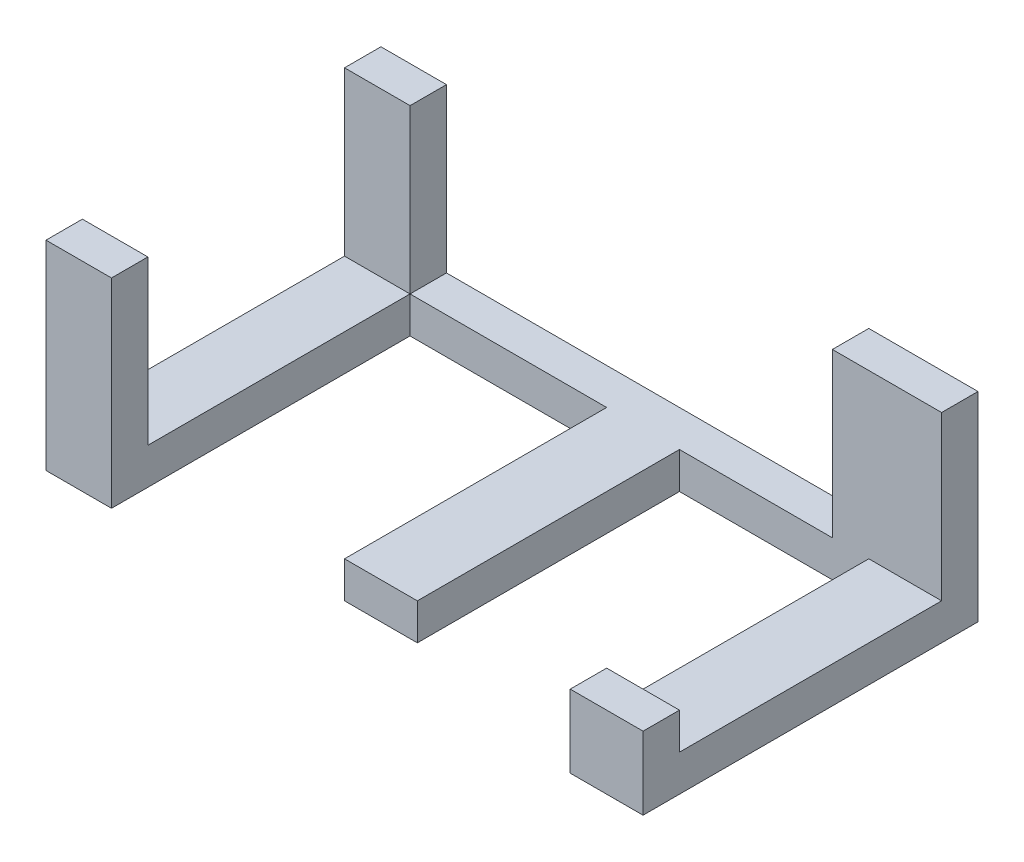
ISO-10303-21;
HEADER;
FILE_DESCRIPTION(('STEP AP214'),'2;1');
FILE_NAME('part.step','',(''),(''),'','','');
FILE_SCHEMA(('AUTOMOTIVE_DESIGN { 1 0 10303 214 1 1 1 1 }'));
ENDSEC;
DATA;
#1=APPLICATION_CONTEXT('core data for automotive mechanical design processes');
#2=APPLICATION_PROTOCOL_DEFINITION('international standard','automotive_design',2000,#1);
#3=PRODUCT_CONTEXT('',#1,'mechanical');
#4=PRODUCT('Part','Part','',(#3));
#5=PRODUCT_RELATED_PRODUCT_CATEGORY('part','',(#4));
#6=PRODUCT_DEFINITION_FORMATION('','',#4);
#7=PRODUCT_DEFINITION_CONTEXT('part definition',#1,'design');
#8=PRODUCT_DEFINITION('design','',#6,#7);
#9=PRODUCT_DEFINITION_SHAPE('','',#8);
#10=(LENGTH_UNIT() NAMED_UNIT(*) SI_UNIT(.MILLI.,.METRE.));
#11=(NAMED_UNIT(*) PLANE_ANGLE_UNIT() SI_UNIT($,.RADIAN.));
#12=(NAMED_UNIT(*) SI_UNIT($,.STERADIAN.) SOLID_ANGLE_UNIT());
#13=UNCERTAINTY_MEASURE_WITH_UNIT(LENGTH_MEASURE(1.E-05),#10,'distance_accuracy_value','');
#14=(GEOMETRIC_REPRESENTATION_CONTEXT(3) GLOBAL_UNCERTAINTY_ASSIGNED_CONTEXT((#13)) GLOBAL_UNIT_ASSIGNED_CONTEXT((#10,
#11,#12)) REPRESENTATION_CONTEXT('',''));
#15=CARTESIAN_POINT('',(0.,0.,0.));
#16=DIRECTION('',(0.,0.,1.));
#17=DIRECTION('',(1.,0.,0.));
#18=AXIS2_PLACEMENT_3D('',#15,#16,#17);
#19=CARTESIAN_POINT('',(0.,0.,5.));
#20=DIRECTION('',(0.,0.,1.));
#21=DIRECTION('',(1.,0.,0.));
#22=AXIS2_PLACEMENT_3D('',#19,#20,#21);
#23=PLANE('',#22);
#24=DIRECTION('',(0.,-1.,0.));
#25=VECTOR('',#24,1.);
#26=CARTESIAN_POINT('',(13.2274700071922,0.,5.));
#27=LINE('',#26,#25);
#28=CARTESIAN_POINT('',(13.2274700071922,-23.4519464720195,5.));
#29=VERTEX_POINT('',#28);
#30=CARTESIAN_POINT('',(13.2274700071922,-28.4519464720195,5.));
#31=VERTEX_POINT('',#30);
#32=EDGE_CURVE('E53',#29,#31,#27,.T.);
#33=ORIENTED_EDGE('',*,*,#32,.F.);
#34=DIRECTION('',(-1.,0.,0.));
#35=VECTOR('',#34,1.);
#36=CARTESIAN_POINT('',(0.,-23.4519464720195,5.));
#37=LINE('',#36,#35);
#38=CARTESIAN_POINT('',(23.2274700071922,-23.4519464720195,5.));
#39=VERTEX_POINT('',#38);
#40=EDGE_CURVE('E247',#39,#29,#37,.T.);
#41=ORIENTED_EDGE('',*,*,#40,.F.);
#42=DIRECTION('',(0.,1.,0.));
#43=VECTOR('',#42,1.);
#44=CARTESIAN_POINT('',(23.2274700071922,-28.4519464720195,5.));
#45=LINE('',#44,#43);
#46=CARTESIAN_POINT('',(23.2274700071922,-1.05194647201947,5.));
#47=VERTEX_POINT('',#46);
#48=EDGE_CURVE('E322',#39,#47,#45,.T.);
#49=ORIENTED_EDGE('',*,*,#48,.T.);
#50=DIRECTION('',(1.,0.,0.));
#51=VECTOR('',#50,1.);
#52=CARTESIAN_POINT('',(8.22747000719218,-1.05194647201947,5.));
#53=LINE('',#52,#51);
#54=CARTESIAN_POINT('',(8.22747000719218,-1.05194647201947,5.));
#55=VERTEX_POINT('',#54);
#56=EDGE_CURVE('E343',#55,#47,#53,.T.);
#57=ORIENTED_EDGE('',*,*,#56,.F.);
#58=DIRECTION('',(0.,-1.,0.));
#59=VECTOR('',#58,1.);
#60=CARTESIAN_POINT('',(8.22747000719218,-1.05194647201947,5.));
#61=LINE('',#60,#59);
#62=CARTESIAN_POINT('',(8.22747000719218,-23.4519464720195,5.));
#63=VERTEX_POINT('',#62);
#64=EDGE_CURVE('E339',#55,#63,#61,.T.);
#65=ORIENTED_EDGE('',*,*,#64,.T.);
#66=DIRECTION('',(-1.,0.,0.));
#67=VECTOR('',#66,1.);
#68=CARTESIAN_POINT('',(-58.7725299928078,-23.4519464720195,5.));
#69=LINE('',#68,#67);
#70=CARTESIAN_POINT('',(-12.7725299928078,-23.4519464720195,5.));
#71=VERTEX_POINT('',#70);
#72=EDGE_CURVE('E329',#63,#71,#69,.T.);
#73=ORIENTED_EDGE('',*,*,#72,.T.);
#74=DIRECTION('',(0.,-1.,0.));
#75=VECTOR('',#74,1.);
#76=CARTESIAN_POINT('',(-12.7725299928078,0.,5.));
#77=LINE('',#76,#75);
#78=CARTESIAN_POINT('',(-12.7725299928078,-28.4519464720195,5.));
#79=VERTEX_POINT('',#78);
#80=EDGE_CURVE('E267',#71,#79,#77,.T.);
#81=ORIENTED_EDGE('',*,*,#80,.T.);
#82=DIRECTION('',(1.,0.,0.));
#83=VECTOR('',#82,1.);
#84=CARTESIAN_POINT('',(-58.7725299928078,-28.4519464720195,5.));
#85=LINE('',#84,#83);
#86=EDGE_CURVE('E58',#79,#31,#85,.T.);
#87=ORIENTED_EDGE('',*,*,#86,.T.);
#88=EDGE_LOOP('',(#33,#41,#49,#57,#65,#73,#81,#87));
#89=FACE_BOUND('',#88,.T.);
#90=ADVANCED_FACE('F35',(#89),#23,.T.);
#91=DIRECTION('',(0.,1.,0.));
#92=VECTOR('',#91,1.);
#93=CARTESIAN_POINT('',(-22.7725299928078,0.,5.));
#94=LINE('',#93,#92);
#95=CARTESIAN_POINT('',(-22.7725299928078,-28.4519464720195,5.));
#96=VERTEX_POINT('',#95);
#97=CARTESIAN_POINT('',(-22.7725299928078,-23.4519464720195,5.));
#98=VERTEX_POINT('',#97);
#99=EDGE_CURVE('E262',#96,#98,#94,.T.);
#100=ORIENTED_EDGE('',*,*,#99,.T.);
#101=CARTESIAN_POINT('',(-49.7725299928078,-23.4519464720195,5.));
#102=VERTEX_POINT('',#101);
#103=EDGE_CURVE('E39',#98,#102,#69,.T.);
#104=ORIENTED_EDGE('',*,*,#103,.T.);
#105=DIRECTION('',(0.,-1.,0.));
#106=VECTOR('',#105,1.);
#107=CARTESIAN_POINT('',(-49.7725299928078,-1.05194647201947,5.));
#108=LINE('',#107,#106);
#109=CARTESIAN_POINT('',(-49.7725299928078,-1.05194647201947,5.));
#110=VERTEX_POINT('',#109);
#111=EDGE_CURVE('E338',#110,#102,#108,.T.);
#112=ORIENTED_EDGE('',*,*,#111,.F.);
#113=DIRECTION('',(1.,0.,0.));
#114=VECTOR('',#113,1.);
#115=CARTESIAN_POINT('',(-49.7725299928078,-1.05194647201947,5.));
#116=LINE('',#115,#114);
#117=CARTESIAN_POINT('',(-58.7725299928078,-1.05194647201947,5.));
#118=VERTEX_POINT('',#117);
#119=EDGE_CURVE('E366',#118,#110,#116,.T.);
#120=ORIENTED_EDGE('',*,*,#119,.F.);
#121=DIRECTION('',(0.,-1.,0.));
#122=VECTOR('',#121,1.);
#123=CARTESIAN_POINT('',(-58.7725299928078,-23.4519464720195,5.));
#124=LINE('',#123,#122);
#125=CARTESIAN_POINT('',(-58.7725299928078,-23.4519464720195,5.));
#126=VERTEX_POINT('',#125);
#127=EDGE_CURVE('E316',#118,#126,#124,.T.);
#128=ORIENTED_EDGE('',*,*,#127,.T.);
#129=DIRECTION('',(-1.,0.,0.));
#130=VECTOR('',#129,1.);
#131=CARTESIAN_POINT('',(0.,-23.4519464720195,5.));
#132=LINE('',#131,#130);
#133=CARTESIAN_POINT('',(-49.7790120037921,-23.4519464720195,5.));
#134=VERTEX_POINT('',#133);
#135=EDGE_CURVE('E293',#134,#126,#132,.T.);
#136=ORIENTED_EDGE('',*,*,#135,.F.);
#137=DIRECTION('',(0.,1.,0.));
#138=VECTOR('',#137,1.);
#139=CARTESIAN_POINT('',(-49.7790120037921,0.,5.));
#140=LINE('',#139,#138);
#141=CARTESIAN_POINT('',(-49.7790120037921,-28.4519464720195,5.));
#142=VERTEX_POINT('',#141);
#143=EDGE_CURVE('E289',#142,#134,#140,.T.);
#144=ORIENTED_EDGE('',*,*,#143,.F.);
#145=EDGE_CURVE('E302',#142,#96,#85,.T.);
#146=ORIENTED_EDGE('',*,*,#145,.T.);
#147=EDGE_LOOP('',(#100,#104,#112,#120,#128,#136,#144,#146));
#148=FACE_BOUND('',#147,.T.);
#149=ADVANCED_FACE('F375',(#148),#23,.T.);
#150=CARTESIAN_POINT('',(-58.7725299928078,-23.4519464720195,5.));
#151=DIRECTION('',(0.,-1.,0.));
#152=DIRECTION('',(0.,0.,-1.));
#153=AXIS2_PLACEMENT_3D('',#150,#151,#152);
#154=PLANE('',#153);
#155=DIRECTION('',(0.,0.,-1.));
#156=VECTOR('',#155,1.);
#157=CARTESIAN_POINT('',(-49.7725299928078,-23.4519464720195,0.));
#158=LINE('',#157,#156);
#159=CARTESIAN_POINT('',(-49.7725299928078,-23.4519464720195,0.));
#160=VERTEX_POINT('',#159);
#161=EDGE_CURVE('E358',#102,#160,#158,.T.);
#162=ORIENTED_EDGE('',*,*,#161,.F.);
#163=ORIENTED_EDGE('',*,*,#103,.F.);
#164=DIRECTION('',(0.,0.,-1.));
#165=VECTOR('',#164,1.);
#166=CARTESIAN_POINT('',(-22.7725299928078,-23.4519464720195,41.));
#167=LINE('',#166,#165);
#168=CARTESIAN_POINT('',(-22.7725299928078,-23.4519464720195,41.));
#169=VERTEX_POINT('',#168);
#170=EDGE_CURVE('E274',#169,#98,#167,.T.);
#171=ORIENTED_EDGE('',*,*,#170,.F.);
#172=DIRECTION('',(-1.,0.,0.));
#173=VECTOR('',#172,1.);
#174=CARTESIAN_POINT('',(0.,-23.4519464720195,41.));
#175=LINE('',#174,#173);
#176=CARTESIAN_POINT('',(-12.7725299928078,-23.4519464720195,41.));
#177=VERTEX_POINT('',#176);
#178=EDGE_CURVE('E272',#177,#169,#175,.T.);
#179=ORIENTED_EDGE('',*,*,#178,.F.);
#180=DIRECTION('',(0.,0.,-1.));
#181=VECTOR('',#180,1.);
#182=CARTESIAN_POINT('',(-12.7725299928078,-23.4519464720195,41.));
#183=LINE('',#182,#181);
#184=EDGE_CURVE('E280',#177,#71,#183,.T.);
#185=ORIENTED_EDGE('',*,*,#184,.T.);
#186=ORIENTED_EDGE('',*,*,#72,.F.);
#187=DIRECTION('',(0.,0.,1.));
#188=VECTOR('',#187,1.);
#189=CARTESIAN_POINT('',(8.22747000719218,-23.4519464720195,0.));
#190=LINE('',#189,#188);
#191=CARTESIAN_POINT('',(8.22747000719212,-23.4519464720195,0.));
#192=VERTEX_POINT('',#191);
#193=EDGE_CURVE('E334',#192,#63,#190,.T.);
#194=ORIENTED_EDGE('',*,*,#193,.F.);
#195=DIRECTION('',(-1.,0.,0.));
#196=VECTOR('',#195,1.);
#197=CARTESIAN_POINT('',(-58.7725299928078,-23.4519464720195,0.));
#198=LINE('',#197,#196);
#199=EDGE_CURVE('E332',#192,#160,#198,.T.);
#200=ORIENTED_EDGE('',*,*,#199,.T.);
#201=EDGE_LOOP('',(#162,#163,#171,#179,#185,#186,#194,#200));
#202=FACE_BOUND('',#201,.T.);
#203=ADVANCED_FACE('F401',(#202),#154,.F.);
#204=CARTESIAN_POINT('',(-58.7725299928078,-23.4519464720195,5.));
#205=DIRECTION('',(1.,0.,0.));
#206=DIRECTION('',(0.,1.,0.));
#207=AXIS2_PLACEMENT_3D('',#204,#205,#206);
#208=PLANE('',#207);
#209=DIRECTION('',(0.,-1.,0.));
#210=VECTOR('',#209,1.);
#211=CARTESIAN_POINT('',(-58.7725299928078,-23.4519464720195,0.));
#212=LINE('',#211,#210);
#213=CARTESIAN_POINT('',(-58.7725299928078,-1.05194647201947,0.));
#214=VERTEX_POINT('',#213);
#215=CARTESIAN_POINT('',(-58.7725299928078,-28.4519464720195,0.));
#216=VERTEX_POINT('',#215);
#217=EDGE_CURVE('E192',#214,#216,#212,.T.);
#218=ORIENTED_EDGE('',*,*,#217,.T.);
#219=DIRECTION('',(0.,0.,-1.));
#220=VECTOR('',#219,1.);
#221=CARTESIAN_POINT('',(-58.7725299928078,-28.4519464720195,5.));
#222=LINE('',#221,#220);
#223=CARTESIAN_POINT('',(-58.7725299928078,-28.4519464720195,46.));
#224=VERTEX_POINT('',#223);
#225=EDGE_CURVE('E11',#224,#216,#222,.T.);
#226=ORIENTED_EDGE('',*,*,#225,.F.);
#227=DIRECTION('',(0.,1.,0.));
#228=VECTOR('',#227,1.);
#229=CARTESIAN_POINT('',(-58.7725299928078,0.,46.));
#230=LINE('',#229,#228);
#231=CARTESIAN_POINT('',(-58.7725299928078,-1.05194647201947,46.));
#232=VERTEX_POINT('',#231);
#233=EDGE_CURVE('E189',#224,#232,#230,.T.);
#234=ORIENTED_EDGE('',*,*,#233,.T.);
#235=DIRECTION('',(0.,0.,-1.));
#236=VECTOR('',#235,1.);
#237=CARTESIAN_POINT('',(-58.7725299928078,-1.05194647201947,46.));
#238=LINE('',#237,#236);
#239=CARTESIAN_POINT('',(-58.7725299928078,-1.05194647201947,41.));
#240=VERTEX_POINT('',#239);
#241=EDGE_CURVE('E215',#232,#240,#238,.T.);
#242=ORIENTED_EDGE('',*,*,#241,.T.);
#243=DIRECTION('',(0.,1.,0.));
#244=VECTOR('',#243,1.);
#245=CARTESIAN_POINT('',(-58.7725299928078,0.,41.));
#246=LINE('',#245,#244);
#247=CARTESIAN_POINT('',(-58.7725299928078,-23.4519464720195,41.));
#248=VERTEX_POINT('',#247);
#249=EDGE_CURVE('E216',#248,#240,#246,.T.);
#250=ORIENTED_EDGE('',*,*,#249,.F.);
#251=DIRECTION('',(0.,0.,-1.));
#252=VECTOR('',#251,1.);
#253=CARTESIAN_POINT('',(-58.7725299928078,-23.4519464720195,41.));
#254=LINE('',#253,#252);
#255=EDGE_CURVE('E305',#248,#126,#254,.T.);
#256=ORIENTED_EDGE('',*,*,#255,.T.);
#257=ORIENTED_EDGE('',*,*,#127,.F.);
#258=DIRECTION('',(0.,0.,1.));
#259=VECTOR('',#258,1.);
#260=CARTESIAN_POINT('',(-58.7725299928078,-1.05194647201947,5.));
#261=LINE('',#260,#259);
#262=EDGE_CURVE('E361',#214,#118,#261,.T.);
#263=ORIENTED_EDGE('',*,*,#262,.F.);
#264=EDGE_LOOP('',(#218,#226,#234,#242,#250,#256,#257,#263));
#265=FACE_BOUND('',#264,.T.);
#266=ADVANCED_FACE('F37',(#265),#208,.F.);
#267=CARTESIAN_POINT('',(-58.7725299928078,-28.4519464720195,5.));
#268=DIRECTION('',(0.,1.,0.));
#269=DIRECTION('',(0.,0.,1.));
#270=AXIS2_PLACEMENT_3D('',#267,#268,#269);
#271=PLANE('',#270);
#272=DIRECTION('',(1.,0.,0.));
#273=VECTOR('',#272,1.);
#274=CARTESIAN_POINT('',(-58.7725299928078,-28.4519464720195,0.));
#275=LINE('',#274,#273);
#276=CARTESIAN_POINT('',(23.2274700071922,-28.4519464720195,0.));
#277=VERTEX_POINT('',#276);
#278=EDGE_CURVE('E385',#216,#277,#275,.T.);
#279=ORIENTED_EDGE('',*,*,#278,.T.);
#280=DIRECTION('',(0.,0.,-1.));
#281=VECTOR('',#280,1.);
#282=CARTESIAN_POINT('',(23.2274700071922,-28.4519464720195,5.));
#283=LINE('',#282,#281);
#284=CARTESIAN_POINT('',(23.2274700071922,-28.4519464720195,46.));
#285=VERTEX_POINT('',#284);
#286=EDGE_CURVE('E45',#285,#277,#283,.T.);
#287=ORIENTED_EDGE('',*,*,#286,.F.);
#288=DIRECTION('',(-1.,0.,0.));
#289=VECTOR('',#288,1.);
#290=CARTESIAN_POINT('',(0.,-28.4519464720195,46.));
#291=LINE('',#290,#289);
#292=CARTESIAN_POINT('',(13.2274700071922,-28.4519464720195,46.));
#293=VERTEX_POINT('',#292);
#294=EDGE_CURVE('E224',#285,#293,#291,.T.);
#295=ORIENTED_EDGE('',*,*,#294,.T.);
#296=DIRECTION('',(0.,0.,-1.));
#297=VECTOR('',#296,1.);
#298=CARTESIAN_POINT('',(13.2274700071922,-28.4519464720195,41.));
#299=LINE('',#298,#297);
#300=EDGE_CURVE('E257',#293,#31,#299,.T.);
#301=ORIENTED_EDGE('',*,*,#300,.T.);
#302=ORIENTED_EDGE('',*,*,#86,.F.);
#303=DIRECTION('',(0.,0.,-1.));
#304=VECTOR('',#303,1.);
#305=CARTESIAN_POINT('',(-12.7725299928078,-28.4519464720195,41.));
#306=LINE('',#305,#304);
#307=CARTESIAN_POINT('',(-12.7725299928078,-28.4519464720195,41.));
#308=VERTEX_POINT('',#307);
#309=EDGE_CURVE('E283',#308,#79,#306,.T.);
#310=ORIENTED_EDGE('',*,*,#309,.F.);
#311=DIRECTION('',(1.,0.,0.));
#312=VECTOR('',#311,1.);
#313=CARTESIAN_POINT('',(0.,-28.4519464720195,41.));
#314=LINE('',#313,#312);
#315=CARTESIAN_POINT('',(-22.7725299928078,-28.4519464720195,41.));
#316=VERTEX_POINT('',#315);
#317=EDGE_CURVE('E266',#316,#308,#314,.T.);
#318=ORIENTED_EDGE('',*,*,#317,.F.);
#319=DIRECTION('',(0.,0.,-1.));
#320=VECTOR('',#319,1.);
#321=CARTESIAN_POINT('',(-22.7725299928078,-28.4519464720195,41.));
#322=LINE('',#321,#320);
#323=EDGE_CURVE('E286',#316,#96,#322,.T.);
#324=ORIENTED_EDGE('',*,*,#323,.T.);
#325=ORIENTED_EDGE('',*,*,#145,.F.);
#326=DIRECTION('',(0.,0.,-1.));
#327=VECTOR('',#326,1.);
#328=CARTESIAN_POINT('',(-49.7790120037921,-28.4519464720195,41.));
#329=LINE('',#328,#327);
#330=CARTESIAN_POINT('',(-49.7790120037921,-28.4519464720195,46.));
#331=VERTEX_POINT('',#330);
#332=EDGE_CURVE('E199',#331,#142,#329,.T.);
#333=ORIENTED_EDGE('',*,*,#332,.F.);
#334=DIRECTION('',(1.,0.,0.));
#335=VECTOR('',#334,1.);
#336=CARTESIAN_POINT('',(0.,-28.4519464720195,46.));
#337=LINE('',#336,#335);
#338=EDGE_CURVE('E195',#224,#331,#337,.T.);
#339=ORIENTED_EDGE('',*,*,#338,.F.);
#340=ORIENTED_EDGE('',*,*,#225,.T.);
#341=EDGE_LOOP('',(#279,#287,#295,#301,#302,#310,#318,#324,#325,#333,#339,#340));
#342=FACE_BOUND('',#341,.T.);
#343=ADVANCED_FACE('F196',(#342),#271,.F.);
#344=CARTESIAN_POINT('',(23.2274700071922,-28.4519464720195,5.));
#345=DIRECTION('',(-1.,0.,0.));
#346=DIRECTION('',(0.,0.,1.));
#347=AXIS2_PLACEMENT_3D('',#344,#345,#346);
#348=PLANE('',#347);
#349=DIRECTION('',(0.,1.,0.));
#350=VECTOR('',#349,1.);
#351=CARTESIAN_POINT('',(23.2274700071922,-28.4519464720195,0.));
#352=LINE('',#351,#350);
#353=CARTESIAN_POINT('',(23.2274700071922,-1.05194647201947,0.));
#354=VERTEX_POINT('',#353);
#355=EDGE_CURVE('E387',#277,#354,#352,.T.);
#356=ORIENTED_EDGE('',*,*,#355,.T.);
#357=DIRECTION('',(0.,0.,-1.));
#358=VECTOR('',#357,1.);
#359=CARTESIAN_POINT('',(23.2274700071922,-1.05194647201947,5.));
#360=LINE('',#359,#358);
#361=EDGE_CURVE('E337',#47,#354,#360,.T.);
#362=ORIENTED_EDGE('',*,*,#361,.F.);
#363=ORIENTED_EDGE('',*,*,#48,.F.);
#364=DIRECTION('',(0.,0.,-1.));
#365=VECTOR('',#364,1.);
#366=CARTESIAN_POINT('',(23.2274700071922,-23.4519464720195,41.));
#367=LINE('',#366,#365);
#368=CARTESIAN_POINT('',(23.2274700071922,-23.4519464720195,41.));
#369=VERTEX_POINT('',#368);
#370=EDGE_CURVE('E251',#369,#39,#367,.T.);
#371=ORIENTED_EDGE('',*,*,#370,.F.);
#372=DIRECTION('',(0.,1.,0.));
#373=VECTOR('',#372,1.);
#374=CARTESIAN_POINT('',(23.2274700071922,0.,41.));
#375=LINE('',#374,#373);
#376=CARTESIAN_POINT('',(23.2274700071922,-18.4519464720195,41.));
#377=VERTEX_POINT('',#376);
#378=EDGE_CURVE('E223',#369,#377,#375,.T.);
#379=ORIENTED_EDGE('',*,*,#378,.T.);
#380=DIRECTION('',(0.,0.,-1.));
#381=VECTOR('',#380,1.);
#382=CARTESIAN_POINT('',(23.2274700071922,-18.4519464720195,46.));
#383=LINE('',#382,#381);
#384=CARTESIAN_POINT('',(23.2274700071922,-18.4519464720195,46.));
#385=VERTEX_POINT('',#384);
#386=EDGE_CURVE('E244',#385,#377,#383,.T.);
#387=ORIENTED_EDGE('',*,*,#386,.F.);
#388=DIRECTION('',(0.,1.,0.));
#389=VECTOR('',#388,1.);
#390=CARTESIAN_POINT('',(23.2274700071922,0.,46.));
#391=LINE('',#390,#389);
#392=EDGE_CURVE('E227',#285,#385,#391,.T.);
#393=ORIENTED_EDGE('',*,*,#392,.F.);
#394=ORIENTED_EDGE('',*,*,#286,.T.);
#395=EDGE_LOOP('',(#356,#362,#363,#371,#379,#387,#393,#394));
#396=FACE_BOUND('',#395,.T.);
#397=ADVANCED_FACE('F410',(#396),#348,.F.);
#398=CARTESIAN_POINT('',(0.,0.,0.));
#399=DIRECTION('',(0.,0.,1.));
#400=DIRECTION('',(1.,0.,0.));
#401=AXIS2_PLACEMENT_3D('',#398,#399,#400);
#402=PLANE('',#401);
#403=ORIENTED_EDGE('',*,*,#217,.F.);
#404=DIRECTION('',(-1.,0.,0.));
#405=VECTOR('',#404,1.);
#406=CARTESIAN_POINT('',(-58.7725299928078,-1.05194647201947,0.));
#407=LINE('',#406,#405);
#408=CARTESIAN_POINT('',(-49.7725299928078,-1.05194647201947,0.));
#409=VERTEX_POINT('',#408);
#410=EDGE_CURVE('E357',#409,#214,#407,.T.);
#411=ORIENTED_EDGE('',*,*,#410,.F.);
#412=DIRECTION('',(0.,-1.,0.));
#413=VECTOR('',#412,1.);
#414=CARTESIAN_POINT('',(-49.7725299928078,-1.05194647201947,0.));
#415=LINE('',#414,#413);
#416=EDGE_CURVE('E354',#409,#160,#415,.T.);
#417=ORIENTED_EDGE('',*,*,#416,.T.);
#418=ORIENTED_EDGE('',*,*,#199,.F.);
#419=DIRECTION('',(0.,-1.,0.));
#420=VECTOR('',#419,1.);
#421=CARTESIAN_POINT('',(8.22747000719218,-1.05194647201947,0.));
#422=LINE('',#421,#420);
#423=CARTESIAN_POINT('',(8.22747000719218,-1.05194647201947,0.));
#424=VERTEX_POINT('',#423);
#425=EDGE_CURVE('E386',#424,#192,#422,.T.);
#426=ORIENTED_EDGE('',*,*,#425,.F.);
#427=DIRECTION('',(-1.,0.,0.));
#428=VECTOR('',#427,1.);
#429=CARTESIAN_POINT('',(23.2274700071922,-1.05194647201947,0.));
#430=LINE('',#429,#428);
#431=EDGE_CURVE('E348',#354,#424,#430,.T.);
#432=ORIENTED_EDGE('',*,*,#431,.F.);
#433=ORIENTED_EDGE('',*,*,#355,.F.);
#434=ORIENTED_EDGE('',*,*,#278,.F.);
#435=EDGE_LOOP('',(#403,#411,#417,#418,#426,#432,#433,#434));
#436=FACE_BOUND('',#435,.T.);
#437=ADVANCED_FACE('F383',(#436),#402,.F.);
#438=CARTESIAN_POINT('',(8.22747000719218,-1.05194647201947,0.));
#439=DIRECTION('',(1.,0.,0.));
#440=DIRECTION('',(0.,0.,-1.));
#441=AXIS2_PLACEMENT_3D('',#438,#439,#440);
#442=PLANE('',#441);
#443=ORIENTED_EDGE('',*,*,#193,.T.);
#444=ORIENTED_EDGE('',*,*,#64,.F.);
#445=DIRECTION('',(0.,0.,1.));
#446=VECTOR('',#445,1.);
#447=CARTESIAN_POINT('',(8.22747000719218,-1.05194647201947,0.));
#448=LINE('',#447,#446);
#449=EDGE_CURVE('E346',#424,#55,#448,.T.);
#450=ORIENTED_EDGE('',*,*,#449,.F.);
#451=ORIENTED_EDGE('',*,*,#425,.T.);
#452=EDGE_LOOP('',(#443,#444,#450,#451));
#453=FACE_BOUND('',#452,.T.);
#454=ADVANCED_FACE('F399',(#453),#442,.F.);
#455=CARTESIAN_POINT('',(0.,-1.05194647201947,0.));
#456=DIRECTION('',(0.,1.,0.));
#457=DIRECTION('',(0.,0.,1.));
#458=AXIS2_PLACEMENT_3D('',#455,#456,#457);
#459=PLANE('',#458);
#460=ORIENTED_EDGE('',*,*,#361,.T.);
#461=ORIENTED_EDGE('',*,*,#431,.T.);
#462=ORIENTED_EDGE('',*,*,#449,.T.);
#463=ORIENTED_EDGE('',*,*,#56,.T.);
#464=EDGE_LOOP('',(#460,#461,#462,#463));
#465=FACE_BOUND('',#464,.T.);
#466=ADVANCED_FACE('F414',(#465),#459,.T.);
#467=CARTESIAN_POINT('',(-49.7725299928078,-1.05194647201947,0.));
#468=DIRECTION('',(-1.,0.,0.));
#469=DIRECTION('',(0.,0.,1.));
#470=AXIS2_PLACEMENT_3D('',#467,#468,#469);
#471=PLANE('',#470);
#472=ORIENTED_EDGE('',*,*,#161,.T.);
#473=ORIENTED_EDGE('',*,*,#416,.F.);
#474=DIRECTION('',(0.,0.,-1.));
#475=VECTOR('',#474,1.);
#476=CARTESIAN_POINT('',(-49.7725299928078,-1.05194647201947,0.));
#477=LINE('',#476,#475);
#478=EDGE_CURVE('E364',#110,#409,#477,.T.);
#479=ORIENTED_EDGE('',*,*,#478,.F.);
#480=ORIENTED_EDGE('',*,*,#111,.T.);
#481=EDGE_LOOP('',(#472,#473,#479,#480));
#482=FACE_BOUND('',#481,.T.);
#483=ADVANCED_FACE('F380',(#482),#471,.F.);
#484=CARTESIAN_POINT('',(0.,-1.05194647201947,0.));
#485=DIRECTION('',(0.,-1.,0.));
#486=DIRECTION('',(0.,0.,-1.));
#487=AXIS2_PLACEMENT_3D('',#484,#485,#486);
#488=PLANE('',#487);
#489=ORIENTED_EDGE('',*,*,#262,.T.);
#490=ORIENTED_EDGE('',*,*,#119,.T.);
#491=ORIENTED_EDGE('',*,*,#478,.T.);
#492=ORIENTED_EDGE('',*,*,#410,.T.);
#493=EDGE_LOOP('',(#489,#490,#491,#492));
#494=FACE_BOUND('',#493,.T.);
#495=ADVANCED_FACE('F369',(#494),#488,.F.);
#496=CARTESIAN_POINT('',(-49.7790120037921,0.,41.));
#497=DIRECTION('',(-1.,0.,0.));
#498=DIRECTION('',(0.,0.,1.));
#499=AXIS2_PLACEMENT_3D('',#496,#497,#498);
#500=PLANE('',#499);
#501=ORIENTED_EDGE('',*,*,#143,.T.);
#502=DIRECTION('',(0.,0.,-1.));
#503=VECTOR('',#502,1.);
#504=CARTESIAN_POINT('',(-49.7790120037921,-23.4519464720195,41.));
#505=LINE('',#504,#503);
#506=CARTESIAN_POINT('',(-49.7790120037921,-23.4519464720195,41.));
#507=VERTEX_POINT('',#506);
#508=EDGE_CURVE('E296',#507,#134,#505,.T.);
#509=ORIENTED_EDGE('',*,*,#508,.F.);
#510=DIRECTION('',(0.,1.,0.));
#511=VECTOR('',#510,1.);
#512=CARTESIAN_POINT('',(-49.7790120037921,0.,41.));
#513=LINE('',#512,#511);
#514=CARTESIAN_POINT('',(-49.7790120037921,-1.05194647201947,41.));
#515=VERTEX_POINT('',#514);
#516=EDGE_CURVE('E210',#507,#515,#513,.T.);
#517=ORIENTED_EDGE('',*,*,#516,.T.);
#518=DIRECTION('',(0.,0.,-1.));
#519=VECTOR('',#518,1.);
#520=CARTESIAN_POINT('',(-49.7790120037921,-1.05194647201947,46.));
#521=LINE('',#520,#519);
#522=CARTESIAN_POINT('',(-49.7790120037921,-1.05194647201947,46.));
#523=VERTEX_POINT('',#522);
#524=EDGE_CURVE('E220',#523,#515,#521,.T.);
#525=ORIENTED_EDGE('',*,*,#524,.F.);
#526=DIRECTION('',(0.,1.,0.));
#527=VECTOR('',#526,1.);
#528=CARTESIAN_POINT('',(-49.7790120037921,0.,46.));
#529=LINE('',#528,#527);
#530=EDGE_CURVE('E202',#331,#523,#529,.T.);
#531=ORIENTED_EDGE('',*,*,#530,.F.);
#532=ORIENTED_EDGE('',*,*,#332,.T.);
#533=EDGE_LOOP('',(#501,#509,#517,#525,#531,#532));
#534=FACE_BOUND('',#533,.T.);
#535=ADVANCED_FACE('F447',(#534),#500,.F.);
#536=CARTESIAN_POINT('',(0.,-23.4519464720195,41.));
#537=DIRECTION('',(0.,-1.,0.));
#538=DIRECTION('',(0.,0.,-1.));
#539=AXIS2_PLACEMENT_3D('',#536,#537,#538);
#540=PLANE('',#539);
#541=ORIENTED_EDGE('',*,*,#135,.T.);
#542=ORIENTED_EDGE('',*,*,#255,.F.);
#543=DIRECTION('',(-1.,0.,0.));
#544=VECTOR('',#543,1.);
#545=CARTESIAN_POINT('',(0.,-23.4519464720195,41.));
#546=LINE('',#545,#544);
#547=EDGE_CURVE('E290',#507,#248,#546,.T.);
#548=ORIENTED_EDGE('',*,*,#547,.F.);
#549=ORIENTED_EDGE('',*,*,#508,.T.);
#550=EDGE_LOOP('',(#541,#542,#548,#549));
#551=FACE_BOUND('',#550,.T.);
#552=ADVANCED_FACE('F457',(#551),#540,.F.);
#553=CARTESIAN_POINT('',(-22.7725299928078,0.,41.));
#554=DIRECTION('',(-1.,0.,0.));
#555=DIRECTION('',(0.,-1.,0.));
#556=AXIS2_PLACEMENT_3D('',#553,#554,#555);
#557=PLANE('',#556);
#558=ORIENTED_EDGE('',*,*,#99,.F.);
#559=ORIENTED_EDGE('',*,*,#323,.F.);
#560=DIRECTION('',(0.,1.,0.));
#561=VECTOR('',#560,1.);
#562=CARTESIAN_POINT('',(-22.7725299928078,0.,41.));
#563=LINE('',#562,#561);
#564=EDGE_CURVE('E263',#316,#169,#563,.T.);
#565=ORIENTED_EDGE('',*,*,#564,.T.);
#566=ORIENTED_EDGE('',*,*,#170,.T.);
#567=EDGE_LOOP('',(#558,#559,#565,#566));
#568=FACE_BOUND('',#567,.T.);
#569=ADVANCED_FACE('F444',(#568),#557,.T.);
#570=CARTESIAN_POINT('',(-12.7725299928078,0.,41.));
#571=DIRECTION('',(1.,0.,0.));
#572=DIRECTION('',(0.,1.,0.));
#573=AXIS2_PLACEMENT_3D('',#570,#571,#572);
#574=PLANE('',#573);
#575=ORIENTED_EDGE('',*,*,#80,.F.);
#576=ORIENTED_EDGE('',*,*,#184,.F.);
#577=DIRECTION('',(0.,-1.,0.));
#578=VECTOR('',#577,1.);
#579=CARTESIAN_POINT('',(-12.7725299928078,0.,41.));
#580=LINE('',#579,#578);
#581=EDGE_CURVE('E269',#177,#308,#580,.T.);
#582=ORIENTED_EDGE('',*,*,#581,.T.);
#583=ORIENTED_EDGE('',*,*,#309,.T.);
#584=EDGE_LOOP('',(#575,#576,#582,#583));
#585=FACE_BOUND('',#584,.T.);
#586=ADVANCED_FACE('F435',(#585),#574,.T.);
#587=CARTESIAN_POINT('',(0.,0.,41.));
#588=DIRECTION('',(0.,0.,1.));
#589=DIRECTION('',(1.,0.,0.));
#590=AXIS2_PLACEMENT_3D('',#587,#588,#589);
#591=PLANE('',#590);
#592=ORIENTED_EDGE('',*,*,#564,.F.);
#593=ORIENTED_EDGE('',*,*,#317,.T.);
#594=ORIENTED_EDGE('',*,*,#581,.F.);
#595=ORIENTED_EDGE('',*,*,#178,.T.);
#596=EDGE_LOOP('',(#592,#593,#594,#595));
#597=FACE_BOUND('',#596,.T.);
#598=ADVANCED_FACE('F440',(#597),#591,.T.);
#599=CARTESIAN_POINT('',(0.,-23.4519464720195,41.));
#600=DIRECTION('',(0.,-1.,0.));
#601=DIRECTION('',(0.,0.,-1.));
#602=AXIS2_PLACEMENT_3D('',#599,#600,#601);
#603=PLANE('',#602);
#604=ORIENTED_EDGE('',*,*,#40,.T.);
#605=DIRECTION('',(0.,0.,-1.));
#606=VECTOR('',#605,1.);
#607=CARTESIAN_POINT('',(13.2274700071922,-23.4519464720195,41.));
#608=LINE('',#607,#606);
#609=CARTESIAN_POINT('',(13.2274700071922,-23.4519464720195,41.));
#610=VERTEX_POINT('',#609);
#611=EDGE_CURVE('E260',#610,#29,#608,.T.);
#612=ORIENTED_EDGE('',*,*,#611,.F.);
#613=DIRECTION('',(-1.,0.,0.));
#614=VECTOR('',#613,1.);
#615=CARTESIAN_POINT('',(0.,-23.4519464720195,41.));
#616=LINE('',#615,#614);
#617=EDGE_CURVE('E248',#369,#610,#616,.T.);
#618=ORIENTED_EDGE('',*,*,#617,.F.);
#619=ORIENTED_EDGE('',*,*,#370,.T.);
#620=EDGE_LOOP('',(#604,#612,#618,#619));
#621=FACE_BOUND('',#620,.T.);
#622=ADVANCED_FACE('F417',(#621),#603,.F.);
#623=CARTESIAN_POINT('',(13.2274700071922,0.,41.));
#624=DIRECTION('',(1.,0.,0.));
#625=DIRECTION('',(0.,0.,-1.));
#626=AXIS2_PLACEMENT_3D('',#623,#624,#625);
#627=PLANE('',#626);
#628=ORIENTED_EDGE('',*,*,#32,.T.);
#629=ORIENTED_EDGE('',*,*,#300,.F.);
#630=DIRECTION('',(0.,1.,0.));
#631=VECTOR('',#630,1.);
#632=CARTESIAN_POINT('',(13.2274700071922,0.,46.));
#633=LINE('',#632,#631);
#634=CARTESIAN_POINT('',(13.2274700071922,-18.4519464720195,46.));
#635=VERTEX_POINT('',#634);
#636=EDGE_CURVE('E233',#293,#635,#633,.T.);
#637=ORIENTED_EDGE('',*,*,#636,.T.);
#638=DIRECTION('',(0.,0.,-1.));
#639=VECTOR('',#638,1.);
#640=CARTESIAN_POINT('',(13.2274700071922,-18.4519464720195,46.));
#641=LINE('',#640,#639);
#642=CARTESIAN_POINT('',(13.2274700071922,-18.4519464720195,41.));
#643=VERTEX_POINT('',#642);
#644=EDGE_CURVE('E236',#635,#643,#641,.T.);
#645=ORIENTED_EDGE('',*,*,#644,.T.);
#646=DIRECTION('',(0.,1.,0.));
#647=VECTOR('',#646,1.);
#648=CARTESIAN_POINT('',(13.2274700071922,0.,41.));
#649=LINE('',#648,#647);
#650=EDGE_CURVE('E228',#610,#643,#649,.T.);
#651=ORIENTED_EDGE('',*,*,#650,.F.);
#652=ORIENTED_EDGE('',*,*,#611,.T.);
#653=EDGE_LOOP('',(#628,#629,#637,#645,#651,#652));
#654=FACE_BOUND('',#653,.T.);
#655=ADVANCED_FACE('F430',(#654),#627,.F.);
#656=CARTESIAN_POINT('',(0.,0.,41.));
#657=DIRECTION('',(0.,0.,1.));
#658=DIRECTION('',(1.,0.,0.));
#659=AXIS2_PLACEMENT_3D('',#656,#657,#658);
#660=PLANE('',#659);
#661=ORIENTED_EDGE('',*,*,#378,.F.);
#662=ORIENTED_EDGE('',*,*,#617,.T.);
#663=ORIENTED_EDGE('',*,*,#650,.T.);
#664=DIRECTION('',(1.,0.,0.));
#665=VECTOR('',#664,1.);
#666=CARTESIAN_POINT('',(0.,-18.4519464720195,41.));
#667=LINE('',#666,#665);
#668=EDGE_CURVE('E238',#643,#377,#667,.T.);
#669=ORIENTED_EDGE('',*,*,#668,.T.);
#670=EDGE_LOOP('',(#661,#662,#663,#669));
#671=FACE_BOUND('',#670,.T.);
#672=ADVANCED_FACE('F421',(#671),#660,.F.);
#673=CARTESIAN_POINT('',(0.,-18.4519464720195,46.));
#674=DIRECTION('',(0.,1.,0.));
#675=DIRECTION('',(0.,0.,1.));
#676=AXIS2_PLACEMENT_3D('',#673,#674,#675);
#677=PLANE('',#676);
#678=ORIENTED_EDGE('',*,*,#668,.F.);
#679=ORIENTED_EDGE('',*,*,#644,.F.);
#680=DIRECTION('',(1.,0.,0.));
#681=VECTOR('',#680,1.);
#682=CARTESIAN_POINT('',(0.,-18.4519464720195,46.));
#683=LINE('',#682,#681);
#684=EDGE_CURVE('E230',#635,#385,#683,.T.);
#685=ORIENTED_EDGE('',*,*,#684,.T.);
#686=ORIENTED_EDGE('',*,*,#386,.T.);
#687=EDGE_LOOP('',(#678,#679,#685,#686));
#688=FACE_BOUND('',#687,.T.);
#689=ADVANCED_FACE('F424',(#688),#677,.T.);
#690=CARTESIAN_POINT('',(0.,0.,46.));
#691=DIRECTION('',(0.,0.,1.));
#692=DIRECTION('',(1.,0.,0.));
#693=AXIS2_PLACEMENT_3D('',#690,#691,#692);
#694=PLANE('',#693);
#695=ORIENTED_EDGE('',*,*,#294,.F.);
#696=ORIENTED_EDGE('',*,*,#392,.T.);
#697=ORIENTED_EDGE('',*,*,#684,.F.);
#698=ORIENTED_EDGE('',*,*,#636,.F.);
#699=EDGE_LOOP('',(#695,#696,#697,#698));
#700=FACE_BOUND('',#699,.T.);
#701=ADVANCED_FACE('F428',(#700),#694,.T.);
#702=CARTESIAN_POINT('',(0.,0.,41.));
#703=DIRECTION('',(0.,0.,1.));
#704=DIRECTION('',(1.,0.,0.));
#705=AXIS2_PLACEMENT_3D('',#702,#703,#704);
#706=PLANE('',#705);
#707=ORIENTED_EDGE('',*,*,#516,.F.);
#708=ORIENTED_EDGE('',*,*,#547,.T.);
#709=ORIENTED_EDGE('',*,*,#249,.T.);
#710=DIRECTION('',(1.,0.,0.));
#711=VECTOR('',#710,1.);
#712=CARTESIAN_POINT('',(0.,-1.05194647201947,41.));
#713=LINE('',#712,#711);
#714=EDGE_CURVE('E207',#240,#515,#713,.T.);
#715=ORIENTED_EDGE('',*,*,#714,.T.);
#716=EDGE_LOOP('',(#707,#708,#709,#715));
#717=FACE_BOUND('',#716,.T.);
#718=ADVANCED_FACE('F455',(#717),#706,.F.);
#719=CARTESIAN_POINT('',(0.,-1.05194647201947,46.));
#720=DIRECTION('',(0.,1.,0.));
#721=DIRECTION('',(0.,0.,1.));
#722=AXIS2_PLACEMENT_3D('',#719,#720,#721);
#723=PLANE('',#722);
#724=ORIENTED_EDGE('',*,*,#714,.F.);
#725=ORIENTED_EDGE('',*,*,#241,.F.);
#726=DIRECTION('',(1.,0.,0.));
#727=VECTOR('',#726,1.);
#728=CARTESIAN_POINT('',(0.,-1.05194647201947,46.));
#729=LINE('',#728,#727);
#730=EDGE_CURVE('E206',#232,#523,#729,.T.);
#731=ORIENTED_EDGE('',*,*,#730,.T.);
#732=ORIENTED_EDGE('',*,*,#524,.T.);
#733=EDGE_LOOP('',(#724,#725,#731,#732));
#734=FACE_BOUND('',#733,.T.);
#735=ADVANCED_FACE('F453',(#734),#723,.T.);
#736=CARTESIAN_POINT('',(0.,0.,46.));
#737=DIRECTION('',(0.,0.,1.));
#738=DIRECTION('',(1.,0.,0.));
#739=AXIS2_PLACEMENT_3D('',#736,#737,#738);
#740=PLANE('',#739);
#741=ORIENTED_EDGE('',*,*,#233,.F.);
#742=ORIENTED_EDGE('',*,*,#338,.T.);
#743=ORIENTED_EDGE('',*,*,#530,.T.);
#744=ORIENTED_EDGE('',*,*,#730,.F.);
#745=EDGE_LOOP('',(#741,#742,#743,#744));
#746=FACE_BOUND('',#745,.T.);
#747=ADVANCED_FACE('F204',(#746),#740,.T.);
#748=CLOSED_SHELL('',(#90,#149,#203,#266,#343,#397,#437,#454,#466,#483,#495,#535,#552,#569,#586,
#598,#622,#655,#672,#689,#701,#718,#735,#747));
#749=MANIFOLD_SOLID_BREP('B2',#748);
#750=ADVANCED_BREP_SHAPE_REPRESENTATION('',(#18,#749),#14);
#751=SHAPE_DEFINITION_REPRESENTATION(#9,#750);
ENDSEC;
END-ISO-10303-21;
